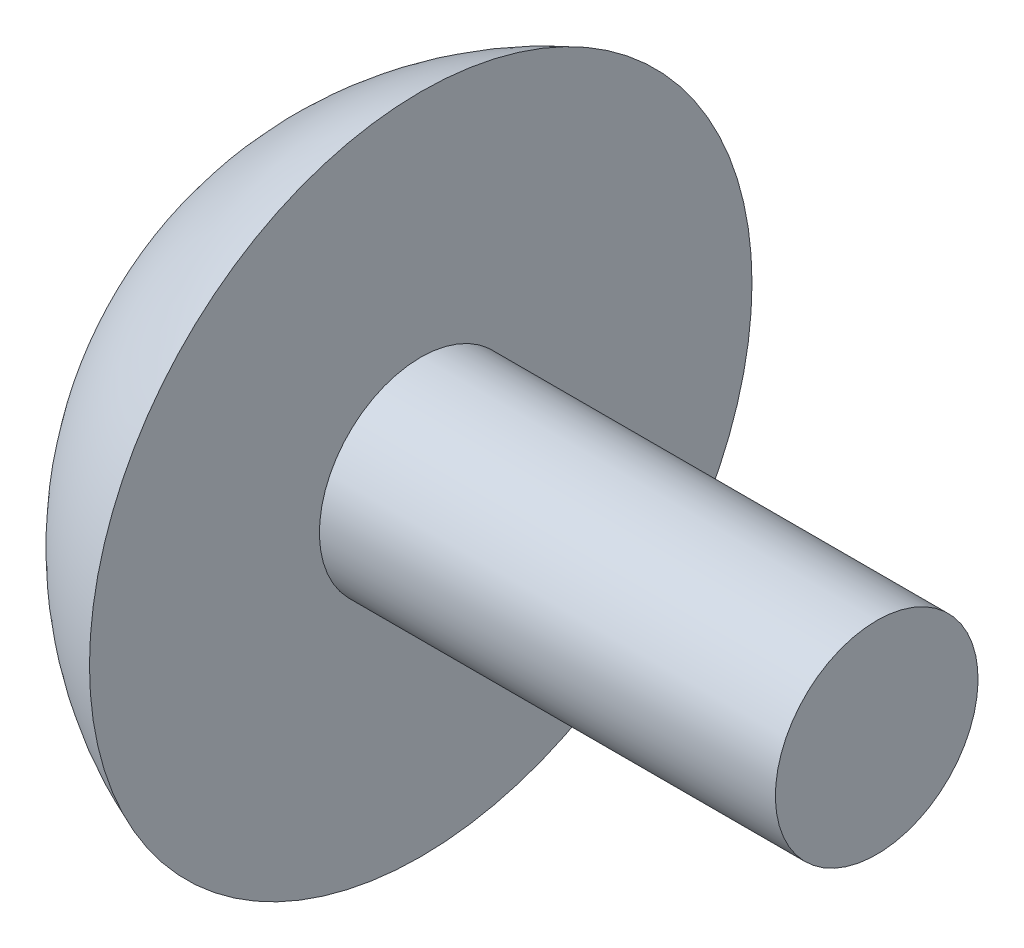
ISO-10303-21;
HEADER;
FILE_DESCRIPTION(('STEP AP214'),'2;1');
FILE_NAME('part.step','',(''),(''),'','','');
FILE_SCHEMA(('AUTOMOTIVE_DESIGN { 1 0 10303 214 1 1 1 1 }'));
ENDSEC;
DATA;
#1=APPLICATION_CONTEXT('core data for automotive mechanical design processes');
#2=APPLICATION_PROTOCOL_DEFINITION('international standard','automotive_design',2000,#1);
#3=PRODUCT_CONTEXT('',#1,'mechanical');
#4=PRODUCT('Part','Part','',(#3));
#5=PRODUCT_RELATED_PRODUCT_CATEGORY('part','',(#4));
#6=PRODUCT_DEFINITION_FORMATION('','',#4);
#7=PRODUCT_DEFINITION_CONTEXT('part definition',#1,'design');
#8=PRODUCT_DEFINITION('design','',#6,#7);
#9=PRODUCT_DEFINITION_SHAPE('','',#8);
#10=(LENGTH_UNIT() NAMED_UNIT(*) SI_UNIT(.MILLI.,.METRE.));
#11=(NAMED_UNIT(*) PLANE_ANGLE_UNIT() SI_UNIT($,.RADIAN.));
#12=(NAMED_UNIT(*) SI_UNIT($,.STERADIAN.) SOLID_ANGLE_UNIT());
#13=UNCERTAINTY_MEASURE_WITH_UNIT(LENGTH_MEASURE(1.E-05),#10,'distance_accuracy_value','');
#14=(GEOMETRIC_REPRESENTATION_CONTEXT(3) GLOBAL_UNCERTAINTY_ASSIGNED_CONTEXT((#13)) GLOBAL_UNIT_ASSIGNED_CONTEXT((#10,
#11,#12)) REPRESENTATION_CONTEXT('',''));
#15=CARTESIAN_POINT('',(0.,0.,0.));
#16=DIRECTION('',(0.,0.,1.));
#17=DIRECTION('',(1.,0.,0.));
#18=AXIS2_PLACEMENT_3D('',#15,#16,#17);
#19=CARTESIAN_POINT('',(0.,0.,0.));
#20=DIRECTION('',(-1.,0.,0.));
#21=DIRECTION('',(0.,-1.,0.));
#22=AXIS2_PLACEMENT_3D('',#19,#20,#21);
#23=PLANE('',#22);
#24=CARTESIAN_POINT('',(0.,0.,0.));
#25=DIRECTION('',(1.,0.,0.));
#26=DIRECTION('',(0.,1.,0.));
#27=AXIS2_PLACEMENT_3D('',#24,#25,#26);
#28=CIRCLE('',#27,2.);
#29=CARTESIAN_POINT('',(0.,2.,0.));
#30=VERTEX_POINT('',#29);
#31=EDGE_CURVE('E41',#30,#30,#28,.T.);
#32=ORIENTED_EDGE('',*,*,#31,.T.);
#33=EDGE_LOOP('',(#32));
#34=FACE_BOUND('',#33,.T.);
#35=ADVANCED_FACE('F31',(#34),#23,.F.);
#36=CARTESIAN_POINT('',(-6.5,0.,0.));
#37=DIRECTION('',(1.,0.,0.));
#38=DIRECTION('',(0.,-1.,0.));
#39=AXIS2_PLACEMENT_3D('',#36,#37,#38);
#40=SPHERICAL_SURFACE('',#39,7.);
#41=CARTESIAN_POINT('',(-9.,0.,0.));
#42=DIRECTION('',(1.,0.,0.));
#43=DIRECTION('',(0.,1.,0.));
#44=AXIS2_PLACEMENT_3D('',#41,#42,#43);
#45=CIRCLE('',#44,6.53834841531101);
#46=CARTESIAN_POINT('',(-9.,6.53834841531101,0.));
#47=VERTEX_POINT('',#46);
#48=EDGE_CURVE('E10',#47,#47,#45,.T.);
#49=ORIENTED_EDGE('',*,*,#48,.F.);
#50=EDGE_LOOP('',(#49));
#51=FACE_BOUND('',#50,.T.);
#52=ADVANCED_FACE('F56',(#51),#40,.T.);
#53=CARTESIAN_POINT('',(-9.,-2.,0.));
#54=DIRECTION('',(-1.,0.,0.));
#55=DIRECTION('',(0.,-1.,0.));
#56=AXIS2_PLACEMENT_3D('',#53,#54,#55);
#57=PLANE('',#56);
#58=CARTESIAN_POINT('',(-9.,0.,0.));
#59=DIRECTION('',(1.,0.,0.));
#60=DIRECTION('',(0.,1.,0.));
#61=AXIS2_PLACEMENT_3D('',#58,#59,#60);
#62=CIRCLE('',#61,2.);
#63=CARTESIAN_POINT('',(-9.,2.,0.));
#64=VERTEX_POINT('',#63);
#65=EDGE_CURVE('E37',#64,#64,#62,.T.);
#66=ORIENTED_EDGE('',*,*,#65,.F.);
#67=EDGE_LOOP('',(#66));
#68=FACE_BOUND('',#67,.T.);
#69=ORIENTED_EDGE('',*,*,#48,.T.);
#70=EDGE_LOOP('',(#69));
#71=FACE_BOUND('',#70,.T.);
#72=ADVANCED_FACE('F51',(#68,#71),#57,.F.);
#73=CARTESIAN_POINT('',(0.,0.,0.));
#74=DIRECTION('',(1.,0.,0.));
#75=DIRECTION('',(0.,1.,0.));
#76=AXIS2_PLACEMENT_3D('',#73,#74,#75);
#77=CYLINDRICAL_SURFACE('',#76,2.);
#78=ORIENTED_EDGE('',*,*,#31,.F.);
#79=EDGE_LOOP('',(#78));
#80=FACE_BOUND('',#79,.T.);
#81=ORIENTED_EDGE('',*,*,#65,.T.);
#82=EDGE_LOOP('',(#81));
#83=FACE_BOUND('',#82,.T.);
#84=ADVANCED_FACE('F49',(#80,#83),#77,.T.);
#85=CLOSED_SHELL('',(#35,#52,#72,#84));
#86=MANIFOLD_SOLID_BREP('B2',#85);
#87=ADVANCED_BREP_SHAPE_REPRESENTATION('',(#18,#86),#14);
#88=SHAPE_DEFINITION_REPRESENTATION(#9,#87);
ENDSEC;
END-ISO-10303-21;
